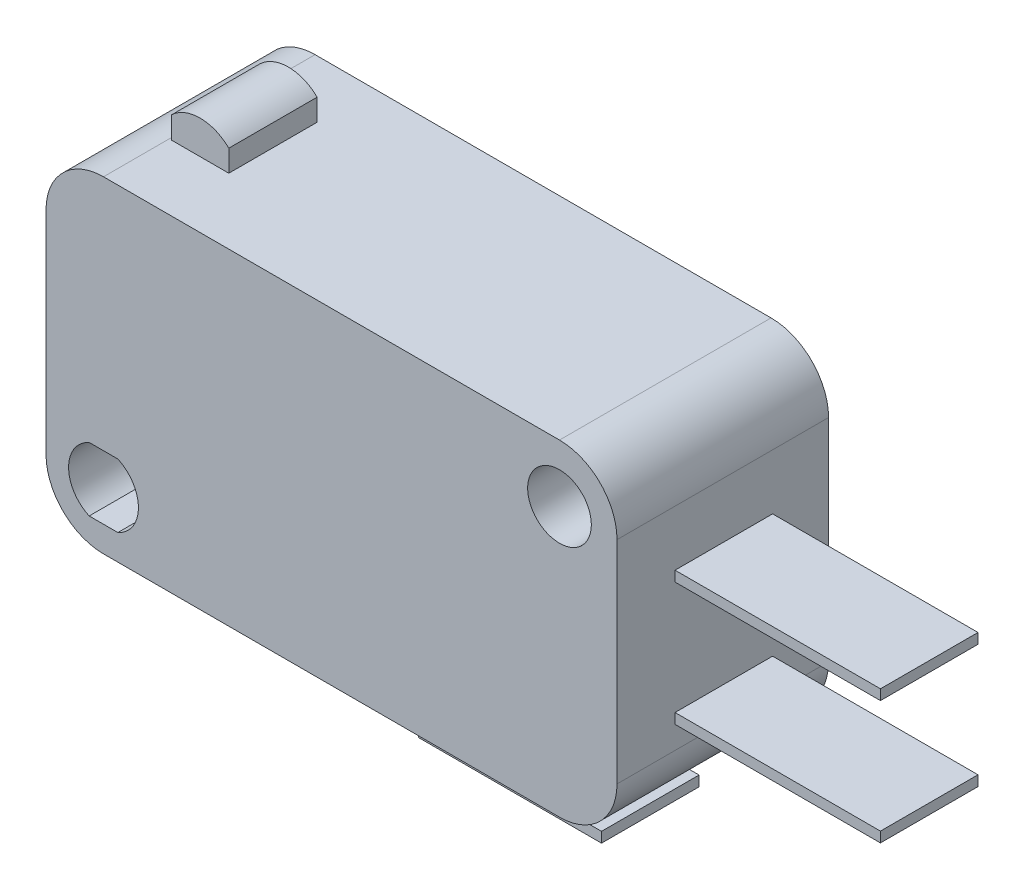
ISO-10303-21;
HEADER;
FILE_DESCRIPTION(('STEP AP214'),'2;1');
FILE_NAME('part.step','',(''),(''),'','','');
FILE_SCHEMA(('AUTOMOTIVE_DESIGN { 1 0 10303 214 1 1 1 1 }'));
ENDSEC;
DATA;
#1=APPLICATION_CONTEXT('core data for automotive mechanical design processes');
#2=APPLICATION_PROTOCOL_DEFINITION('international standard','automotive_design',2000,#1);
#3=PRODUCT_CONTEXT('',#1,'mechanical');
#4=PRODUCT('Part','Part','',(#3));
#5=PRODUCT_RELATED_PRODUCT_CATEGORY('part','',(#4));
#6=PRODUCT_DEFINITION_FORMATION('','',#4);
#7=PRODUCT_DEFINITION_CONTEXT('part definition',#1,'design');
#8=PRODUCT_DEFINITION('design','',#6,#7);
#9=PRODUCT_DEFINITION_SHAPE('','',#8);
#10=(LENGTH_UNIT() NAMED_UNIT(*) SI_UNIT(.MILLI.,.METRE.));
#11=(NAMED_UNIT(*) PLANE_ANGLE_UNIT() SI_UNIT($,.RADIAN.));
#12=(NAMED_UNIT(*) SI_UNIT($,.STERADIAN.) SOLID_ANGLE_UNIT());
#13=UNCERTAINTY_MEASURE_WITH_UNIT(LENGTH_MEASURE(1.E-05),#10,'distance_accuracy_value','');
#14=(GEOMETRIC_REPRESENTATION_CONTEXT(3) GLOBAL_UNCERTAINTY_ASSIGNED_CONTEXT((#13)) GLOBAL_UNIT_ASSIGNED_CONTEXT((#10,
#11,#12)) REPRESENTATION_CONTEXT('',''));
#15=CARTESIAN_POINT('',(0.,0.,0.));
#16=DIRECTION('',(0.,0.,1.));
#17=DIRECTION('',(1.,0.,0.));
#18=AXIS2_PLACEMENT_3D('',#15,#16,#17);
#19=CARTESIAN_POINT('',(-25.,-13.1,5.15));
#20=DIRECTION('',(0.,1.,0.));
#21=DIRECTION('',(-1.,0.,0.));
#22=AXIS2_PLACEMENT_3D('',#19,#20,#21);
#23=PLANE('',#22);
#24=DIRECTION('',(1.,0.,0.));
#25=VECTOR('',#24,1.);
#26=CARTESIAN_POINT('',(-25.,-13.1,5.15));
#27=LINE('',#26,#25);
#28=CARTESIAN_POINT('',(-22.2,-13.1,5.15));
#29=VERTEX_POINT('',#28);
#30=CARTESIAN_POINT('',(0.,-13.1,5.15));
#31=VERTEX_POINT('',#30);
#32=EDGE_CURVE('E411',#29,#31,#27,.T.);
#33=ORIENTED_EDGE('',*,*,#32,.F.);
#34=DIRECTION('',(0.,0.,-1.));
#35=VECTOR('',#34,1.);
#36=CARTESIAN_POINT('',(-22.2,-13.1,5.15));
#37=LINE('',#36,#35);
#38=CARTESIAN_POINT('',(-22.2,-13.1,-5.15));
#39=VERTEX_POINT('',#38);
#40=EDGE_CURVE('E448',#29,#39,#37,.T.);
#41=ORIENTED_EDGE('',*,*,#40,.T.);
#42=DIRECTION('',(1.,0.,0.));
#43=VECTOR('',#42,1.);
#44=CARTESIAN_POINT('',(-25.,-13.1,-5.15));
#45=LINE('',#44,#43);
#46=CARTESIAN_POINT('',(0.,-13.1,-5.15));
#47=VERTEX_POINT('',#46);
#48=EDGE_CURVE('E399',#39,#47,#45,.T.);
#49=ORIENTED_EDGE('',*,*,#48,.T.);
#50=DIRECTION('',(0.,0.,-1.));
#51=VECTOR('',#50,1.);
#52=CARTESIAN_POINT('',(0.,-13.1,5.15));
#53=LINE('',#52,#51);
#54=EDGE_CURVE('E446',#47,#31,#53,.F.);
#55=ORIENTED_EDGE('',*,*,#54,.T.);
#56=EDGE_LOOP('',(#33,#41,#49,#55));
#57=FACE_BOUND('',#56,.T.);
#58=DIRECTION('',(-1.,0.,0.));
#59=VECTOR('',#58,1.);
#60=CARTESIAN_POINT('',(-9.68,-13.1,2.325));
#61=LINE('',#60,#59);
#62=CARTESIAN_POINT('',(-9.18,-13.1,2.325));
#63=VERTEX_POINT('',#62);
#64=CARTESIAN_POINT('',(-9.68,-13.1,2.325));
#65=VERTEX_POINT('',#64);
#66=EDGE_CURVE('E300',#63,#65,#61,.T.);
#67=ORIENTED_EDGE('',*,*,#66,.F.);
#68=DIRECTION('',(0.,0.,-1.));
#69=VECTOR('',#68,1.);
#70=CARTESIAN_POINT('',(-9.18,-13.1,2.325));
#71=LINE('',#70,#69);
#72=CARTESIAN_POINT('',(-9.18,-13.1,-2.425));
#73=VERTEX_POINT('',#72);
#74=EDGE_CURVE('E313',#63,#73,#71,.T.);
#75=ORIENTED_EDGE('',*,*,#74,.T.);
#76=DIRECTION('',(-1.,0.,0.));
#77=VECTOR('',#76,1.);
#78=CARTESIAN_POINT('',(-9.68,-13.1,-2.425));
#79=LINE('',#78,#77);
#80=CARTESIAN_POINT('',(-9.68,-13.1,-2.425));
#81=VERTEX_POINT('',#80);
#82=EDGE_CURVE('E287',#73,#81,#79,.T.);
#83=ORIENTED_EDGE('',*,*,#82,.T.);
#84=DIRECTION('',(0.,0.,-1.));
#85=VECTOR('',#84,1.);
#86=CARTESIAN_POINT('',(-9.68,-13.1,2.325));
#87=LINE('',#86,#85);
#88=EDGE_CURVE('E328',#65,#81,#87,.T.);
#89=ORIENTED_EDGE('',*,*,#88,.F.);
#90=EDGE_LOOP('',(#67,#75,#83,#89));
#91=FACE_BOUND('',#90,.T.);
#92=ADVANCED_FACE('F17',(#57,#91),#23,.F.);
#93=CARTESIAN_POINT('',(2.8,2.8,5.15));
#94=DIRECTION('',(-1.,0.,0.));
#95=DIRECTION('',(0.,-1.,0.));
#96=AXIS2_PLACEMENT_3D('',#93,#94,#95);
#97=PLANE('',#96);
#98=DIRECTION('',(0.,-1.,0.));
#99=VECTOR('',#98,1.);
#100=CARTESIAN_POINT('',(2.8,-2.7,2.325));
#101=LINE('',#100,#99);
#102=CARTESIAN_POINT('',(2.8,-2.7,2.325));
#103=VERTEX_POINT('',#102);
#104=CARTESIAN_POINT('',(2.8,-3.2,2.325));
#105=VERTEX_POINT('',#104);
#106=EDGE_CURVE('E363',#103,#105,#101,.T.);
#107=ORIENTED_EDGE('',*,*,#106,.F.);
#108=DIRECTION('',(0.,0.,1.));
#109=VECTOR('',#108,1.);
#110=CARTESIAN_POINT('',(2.8,-2.7,2.325));
#111=LINE('',#110,#109);
#112=CARTESIAN_POINT('',(2.8,-2.7,-2.425));
#113=VERTEX_POINT('',#112);
#114=EDGE_CURVE('E372',#113,#103,#111,.T.);
#115=ORIENTED_EDGE('',*,*,#114,.F.);
#116=DIRECTION('',(0.,1.,0.));
#117=VECTOR('',#116,1.);
#118=CARTESIAN_POINT('',(2.8,-2.7,-2.425));
#119=LINE('',#118,#117);
#120=CARTESIAN_POINT('',(2.8,-3.2,-2.425));
#121=VERTEX_POINT('',#120);
#122=EDGE_CURVE('E369',#121,#113,#119,.T.);
#123=ORIENTED_EDGE('',*,*,#122,.F.);
#124=DIRECTION('',(0.,0.,-1.));
#125=VECTOR('',#124,1.);
#126=CARTESIAN_POINT('',(2.8,-3.2,2.325));
#127=LINE('',#126,#125);
#128=EDGE_CURVE('E366',#105,#121,#127,.T.);
#129=ORIENTED_EDGE('',*,*,#128,.F.);
#130=EDGE_LOOP('',(#107,#115,#123,#129));
#131=FACE_BOUND('',#130,.T.);
#132=DIRECTION('',(0.,1.,0.));
#133=VECTOR('',#132,1.);
#134=CARTESIAN_POINT('',(2.8,2.8,5.15));
#135=LINE('',#134,#133);
#136=CARTESIAN_POINT('',(2.8,-10.3,5.15));
#137=VERTEX_POINT('',#136);
#138=CARTESIAN_POINT('',(2.8,0.,5.15));
#139=VERTEX_POINT('',#138);
#140=EDGE_CURVE('E414',#137,#139,#135,.T.);
#141=ORIENTED_EDGE('',*,*,#140,.F.);
#142=DIRECTION('',(0.,0.,-1.));
#143=VECTOR('',#142,1.);
#144=CARTESIAN_POINT('',(2.8,-10.3,5.15));
#145=LINE('',#144,#143);
#146=CARTESIAN_POINT('',(2.8,-10.3,-5.15));
#147=VERTEX_POINT('',#146);
#148=EDGE_CURVE('E11',#137,#147,#145,.T.);
#149=ORIENTED_EDGE('',*,*,#148,.T.);
#150=DIRECTION('',(0.,1.,0.));
#151=VECTOR('',#150,1.);
#152=CARTESIAN_POINT('',(2.8,2.8,-5.15));
#153=LINE('',#152,#151);
#154=CARTESIAN_POINT('',(2.8,0.,-5.15));
#155=VERTEX_POINT('',#154);
#156=EDGE_CURVE('E402',#147,#155,#153,.T.);
#157=ORIENTED_EDGE('',*,*,#156,.T.);
#158=DIRECTION('',(0.,0.,-1.));
#159=VECTOR('',#158,1.);
#160=CARTESIAN_POINT('',(2.8,0.,5.15));
#161=LINE('',#160,#159);
#162=EDGE_CURVE('E25',#155,#139,#161,.F.);
#163=ORIENTED_EDGE('',*,*,#162,.T.);
#164=EDGE_LOOP('',(#141,#149,#157,#163));
#165=FACE_BOUND('',#164,.T.);
#166=DIRECTION('',(0.,-1.,0.));
#167=VECTOR('',#166,1.);
#168=CARTESIAN_POINT('',(2.8,-8.7,2.325));
#169=LINE('',#168,#167);
#170=CARTESIAN_POINT('',(2.8,-8.7,2.325));
#171=VERTEX_POINT('',#170);
#172=CARTESIAN_POINT('',(2.8,-9.2,2.325));
#173=VERTEX_POINT('',#172);
#174=EDGE_CURVE('E330',#171,#173,#169,.T.);
#175=ORIENTED_EDGE('',*,*,#174,.F.);
#176=DIRECTION('',(0.,0.,1.));
#177=VECTOR('',#176,1.);
#178=CARTESIAN_POINT('',(2.8,-8.7,2.325));
#179=LINE('',#178,#177);
#180=CARTESIAN_POINT('',(2.8,-8.7,-2.425));
#181=VERTEX_POINT('',#180);
#182=EDGE_CURVE('E339',#181,#171,#179,.T.);
#183=ORIENTED_EDGE('',*,*,#182,.F.);
#184=DIRECTION('',(0.,1.,0.));
#185=VECTOR('',#184,1.);
#186=CARTESIAN_POINT('',(2.8,-8.7,-2.425));
#187=LINE('',#186,#185);
#188=CARTESIAN_POINT('',(2.8,-9.2,-2.425));
#189=VERTEX_POINT('',#188);
#190=EDGE_CURVE('E336',#189,#181,#187,.T.);
#191=ORIENTED_EDGE('',*,*,#190,.F.);
#192=DIRECTION('',(0.,0.,-1.));
#193=VECTOR('',#192,1.);
#194=CARTESIAN_POINT('',(2.8,-9.2,2.325));
#195=LINE('',#194,#193);
#196=EDGE_CURVE('E333',#173,#189,#195,.T.);
#197=ORIENTED_EDGE('',*,*,#196,.F.);
#198=EDGE_LOOP('',(#175,#183,#191,#197));
#199=FACE_BOUND('',#198,.T.);
#200=ADVANCED_FACE('F453',(#131,#165,#199),#97,.F.);
#201=CARTESIAN_POINT('',(-25.,2.8,5.15));
#202=DIRECTION('',(1.,0.,0.));
#203=DIRECTION('',(0.,1.,0.));
#204=AXIS2_PLACEMENT_3D('',#201,#202,#203);
#205=PLANE('',#204);
#206=DIRECTION('',(0.,-1.,0.));
#207=VECTOR('',#206,1.);
#208=CARTESIAN_POINT('',(-25.,2.8,5.15));
#209=LINE('',#208,#207);
#210=CARTESIAN_POINT('',(-25.,0.,5.15));
#211=VERTEX_POINT('',#210);
#212=CARTESIAN_POINT('',(-25.,-10.3,5.15));
#213=VERTEX_POINT('',#212);
#214=EDGE_CURVE('E408',#211,#213,#209,.T.);
#215=ORIENTED_EDGE('',*,*,#214,.F.);
#216=DIRECTION('',(0.,0.,-1.));
#217=VECTOR('',#216,1.);
#218=CARTESIAN_POINT('',(-25.,0.,5.15));
#219=LINE('',#218,#217);
#220=CARTESIAN_POINT('',(-25.,0.,-5.15));
#221=VERTEX_POINT('',#220);
#222=EDGE_CURVE('E422',#211,#221,#219,.T.);
#223=ORIENTED_EDGE('',*,*,#222,.T.);
#224=DIRECTION('',(0.,-1.,0.));
#225=VECTOR('',#224,1.);
#226=CARTESIAN_POINT('',(-25.,2.8,-5.15));
#227=LINE('',#226,#225);
#228=CARTESIAN_POINT('',(-25.,-10.3,-5.15));
#229=VERTEX_POINT('',#228);
#230=EDGE_CURVE('E396',#221,#229,#227,.T.);
#231=ORIENTED_EDGE('',*,*,#230,.T.);
#232=DIRECTION('',(0.,0.,-1.));
#233=VECTOR('',#232,1.);
#234=CARTESIAN_POINT('',(-25.,-10.3,5.15));
#235=LINE('',#234,#233);
#236=EDGE_CURVE('E420',#229,#213,#235,.F.);
#237=ORIENTED_EDGE('',*,*,#236,.T.);
#238=EDGE_LOOP('',(#215,#223,#231,#237));
#239=FACE_BOUND('',#238,.T.);
#240=ADVANCED_FACE('F19',(#239),#205,.F.);
#241=CARTESIAN_POINT('',(-25.,2.8,5.15));
#242=DIRECTION('',(0.,-1.,0.));
#243=DIRECTION('',(0.,0.,-1.));
#244=AXIS2_PLACEMENT_3D('',#241,#242,#243);
#245=PLANE('',#244);
#246=DIRECTION('',(0.,0.,-1.));
#247=VECTOR('',#246,1.);
#248=CARTESIAN_POINT('',(-19.3,2.8,1.95));
#249=LINE('',#248,#247);
#250=CARTESIAN_POINT('',(-19.3,2.8,1.95));
#251=VERTEX_POINT('',#250);
#252=CARTESIAN_POINT('',(-19.3,2.8,-2.35));
#253=VERTEX_POINT('',#252);
#254=EDGE_CURVE('E32',#251,#253,#249,.T.);
#255=ORIENTED_EDGE('',*,*,#254,.F.);
#256=DIRECTION('',(1.,0.,0.));
#257=VECTOR('',#256,1.);
#258=CARTESIAN_POINT('',(-22.1,2.8,1.95));
#259=LINE('',#258,#257);
#260=CARTESIAN_POINT('',(-22.1,2.8,1.95));
#261=VERTEX_POINT('',#260);
#262=EDGE_CURVE('E36',#261,#251,#259,.T.);
#263=ORIENTED_EDGE('',*,*,#262,.F.);
#264=DIRECTION('',(0.,0.,-1.));
#265=VECTOR('',#264,1.);
#266=CARTESIAN_POINT('',(-22.1,2.8,1.95));
#267=LINE('',#266,#265);
#268=CARTESIAN_POINT('',(-22.1,2.8,-2.35));
#269=VERTEX_POINT('',#268);
#270=EDGE_CURVE('E247',#261,#269,#267,.T.);
#271=ORIENTED_EDGE('',*,*,#270,.T.);
#272=DIRECTION('',(1.,0.,0.));
#273=VECTOR('',#272,1.);
#274=CARTESIAN_POINT('',(-22.1,2.8,-2.35));
#275=LINE('',#274,#273);
#276=EDGE_CURVE('E238',#269,#253,#275,.T.);
#277=ORIENTED_EDGE('',*,*,#276,.T.);
#278=EDGE_LOOP('',(#255,#263,#271,#277));
#279=FACE_BOUND('',#278,.T.);
#280=DIRECTION('',(-1.,0.,0.));
#281=VECTOR('',#280,1.);
#282=CARTESIAN_POINT('',(-25.,2.8,-5.15));
#283=LINE('',#282,#281);
#284=CARTESIAN_POINT('',(0.,2.8,-5.15));
#285=VERTEX_POINT('',#284);
#286=CARTESIAN_POINT('',(-22.2,2.8,-5.15));
#287=VERTEX_POINT('',#286);
#288=EDGE_CURVE('E405',#285,#287,#283,.T.);
#289=ORIENTED_EDGE('',*,*,#288,.T.);
#290=DIRECTION('',(0.,0.,-1.));
#291=VECTOR('',#290,1.);
#292=CARTESIAN_POINT('',(-22.2,2.8,5.15));
#293=LINE('',#292,#291);
#294=CARTESIAN_POINT('',(-22.2,2.8,5.15));
#295=VERTEX_POINT('',#294);
#296=EDGE_CURVE('E436',#287,#295,#293,.F.);
#297=ORIENTED_EDGE('',*,*,#296,.T.);
#298=DIRECTION('',(-1.,0.,0.));
#299=VECTOR('',#298,1.);
#300=CARTESIAN_POINT('',(-25.,2.8,5.15));
#301=LINE('',#300,#299);
#302=CARTESIAN_POINT('',(0.,2.8,5.15));
#303=VERTEX_POINT('',#302);
#304=EDGE_CURVE('E417',#303,#295,#301,.T.);
#305=ORIENTED_EDGE('',*,*,#304,.F.);
#306=DIRECTION('',(0.,0.,-1.));
#307=VECTOR('',#306,1.);
#308=CARTESIAN_POINT('',(0.,2.8,5.15));
#309=LINE('',#308,#307);
#310=EDGE_CURVE('E433',#303,#285,#309,.T.);
#311=ORIENTED_EDGE('',*,*,#310,.T.);
#312=EDGE_LOOP('',(#289,#297,#305,#311));
#313=FACE_BOUND('',#312,.T.);
#314=ADVANCED_FACE('F467',(#279,#313),#245,.F.);
#315=CARTESIAN_POINT('',(-25.,2.8,5.15));
#316=DIRECTION('',(0.,0.,1.));
#317=DIRECTION('',(1.,0.,0.));
#318=AXIS2_PLACEMENT_3D('',#315,#316,#317);
#319=PLANE('',#318);
#320=CARTESIAN_POINT('',(-22.2,-10.3,5.15));
#321=DIRECTION('',(0.,0.,1.));
#322=DIRECTION('',(1.,0.,0.));
#323=AXIS2_PLACEMENT_3D('',#320,#321,#322);
#324=CIRCLE('',#323,1.7);
#325=CARTESIAN_POINT('',(-22.8982120021885,-8.75,5.15));
#326=VERTEX_POINT('',#325);
#327=CARTESIAN_POINT('',(-22.8982120021885,-11.85,5.15));
#328=VERTEX_POINT('',#327);
#329=EDGE_CURVE('E222',#326,#328,#324,.T.);
#330=ORIENTED_EDGE('',*,*,#329,.F.);
#331=DIRECTION('',(-1.,0.,0.));
#332=VECTOR('',#331,1.);
#333=CARTESIAN_POINT('',(-22.8982120021885,-8.75,5.15));
#334=LINE('',#333,#332);
#335=CARTESIAN_POINT('',(-21.5017879978116,-8.75,5.15));
#336=VERTEX_POINT('',#335);
#337=EDGE_CURVE('E257',#336,#326,#334,.T.);
#338=ORIENTED_EDGE('',*,*,#337,.F.);
#339=CARTESIAN_POINT('',(-22.2,-10.3,5.15));
#340=DIRECTION('',(0.,0.,1.));
#341=DIRECTION('',(1.,0.,0.));
#342=AXIS2_PLACEMENT_3D('',#339,#340,#341);
#343=CIRCLE('',#342,1.7);
#344=CARTESIAN_POINT('',(-21.5017879978116,-11.85,5.15));
#345=VERTEX_POINT('',#344);
#346=EDGE_CURVE('E254',#345,#336,#343,.T.);
#347=ORIENTED_EDGE('',*,*,#346,.F.);
#348=DIRECTION('',(1.,0.,0.));
#349=VECTOR('',#348,1.);
#350=CARTESIAN_POINT('',(-22.8982120021885,-11.85,5.15));
#351=LINE('',#350,#349);
#352=EDGE_CURVE('E251',#328,#345,#351,.T.);
#353=ORIENTED_EDGE('',*,*,#352,.F.);
#354=EDGE_LOOP('',(#330,#338,#347,#353));
#355=FACE_BOUND('',#354,.T.);
#356=CARTESIAN_POINT('',(0.,0.,5.15));
#357=DIRECTION('',(0.,0.,1.));
#358=DIRECTION('',(1.,0.,0.));
#359=AXIS2_PLACEMENT_3D('',#356,#357,#358);
#360=CIRCLE('',#359,1.55);
#361=CARTESIAN_POINT('',(1.55,0.,5.15));
#362=VERTEX_POINT('',#361);
#363=EDGE_CURVE('E275',#362,#362,#360,.T.);
#364=ORIENTED_EDGE('',*,*,#363,.F.);
#365=EDGE_LOOP('',(#364));
#366=FACE_BOUND('',#365,.T.);
#367=ORIENTED_EDGE('',*,*,#304,.T.);
#368=CARTESIAN_POINT('',(-22.2,0.,5.15));
#369=DIRECTION('',(0.,0.,1.));
#370=DIRECTION('',(1.,0.,0.));
#371=AXIS2_PLACEMENT_3D('',#368,#369,#370);
#372=CIRCLE('',#371,2.8);
#373=EDGE_CURVE('E444',#295,#211,#372,.T.);
#374=ORIENTED_EDGE('',*,*,#373,.T.);
#375=ORIENTED_EDGE('',*,*,#214,.T.);
#376=CARTESIAN_POINT('',(-22.2,-10.3,5.15));
#377=DIRECTION('',(0.,0.,1.));
#378=DIRECTION('',(1.,0.,0.));
#379=AXIS2_PLACEMENT_3D('',#376,#377,#378);
#380=CIRCLE('',#379,2.8);
#381=EDGE_CURVE('E442',#213,#29,#380,.T.);
#382=ORIENTED_EDGE('',*,*,#381,.T.);
#383=ORIENTED_EDGE('',*,*,#32,.T.);
#384=CARTESIAN_POINT('',(0.,-10.3,5.15));
#385=DIRECTION('',(0.,0.,1.));
#386=DIRECTION('',(1.,0.,0.));
#387=AXIS2_PLACEMENT_3D('',#384,#385,#386);
#388=CIRCLE('',#387,2.8);
#389=EDGE_CURVE('E440',#31,#137,#388,.T.);
#390=ORIENTED_EDGE('',*,*,#389,.T.);
#391=ORIENTED_EDGE('',*,*,#140,.T.);
#392=CARTESIAN_POINT('',(0.,0.,5.15));
#393=DIRECTION('',(0.,0.,1.));
#394=DIRECTION('',(1.,0.,0.));
#395=AXIS2_PLACEMENT_3D('',#392,#393,#394);
#396=CIRCLE('',#395,2.8);
#397=EDGE_CURVE('E438',#139,#303,#396,.T.);
#398=ORIENTED_EDGE('',*,*,#397,.T.);
#399=EDGE_LOOP('',(#367,#374,#375,#382,#383,#390,#391,#398));
#400=FACE_BOUND('',#399,.T.);
#401=ADVANCED_FACE('F460',(#355,#366,#400),#319,.T.);
#402=CARTESIAN_POINT('',(-25.,2.8,-5.15));
#403=DIRECTION('',(0.,0.,1.));
#404=DIRECTION('',(1.,0.,0.));
#405=AXIS2_PLACEMENT_3D('',#402,#403,#404);
#406=PLANE('',#405);
#407=DIRECTION('',(-1.,0.,0.));
#408=VECTOR('',#407,1.);
#409=CARTESIAN_POINT('',(-22.8982120021885,-8.75,-5.15));
#410=LINE('',#409,#408);
#411=CARTESIAN_POINT('',(-21.5017879978116,-8.75,-5.15));
#412=VERTEX_POINT('',#411);
#413=CARTESIAN_POINT('',(-22.8982120021885,-8.75,-5.15));
#414=VERTEX_POINT('',#413);
#415=EDGE_CURVE('E269',#412,#414,#410,.T.);
#416=ORIENTED_EDGE('',*,*,#415,.T.);
#417=CARTESIAN_POINT('',(-22.2,-10.3,-5.15));
#418=DIRECTION('',(0.,0.,1.));
#419=DIRECTION('',(1.,0.,0.));
#420=AXIS2_PLACEMENT_3D('',#417,#418,#419);
#421=CIRCLE('',#420,1.7);
#422=CARTESIAN_POINT('',(-22.8982120021885,-11.85,-5.15));
#423=VERTEX_POINT('',#422);
#424=EDGE_CURVE('E260',#414,#423,#421,.T.);
#425=ORIENTED_EDGE('',*,*,#424,.T.);
#426=DIRECTION('',(1.,0.,0.));
#427=VECTOR('',#426,1.);
#428=CARTESIAN_POINT('',(-22.8982120021885,-11.85,-5.15));
#429=LINE('',#428,#427);
#430=CARTESIAN_POINT('',(-21.5017879978116,-11.85,-5.15));
#431=VERTEX_POINT('',#430);
#432=EDGE_CURVE('E263',#423,#431,#429,.T.);
#433=ORIENTED_EDGE('',*,*,#432,.T.);
#434=CARTESIAN_POINT('',(-22.2,-10.3,-5.15));
#435=DIRECTION('',(0.,0.,1.));
#436=DIRECTION('',(1.,0.,0.));
#437=AXIS2_PLACEMENT_3D('',#434,#435,#436);
#438=CIRCLE('',#437,1.7);
#439=EDGE_CURVE('E266',#431,#412,#438,.T.);
#440=ORIENTED_EDGE('',*,*,#439,.T.);
#441=EDGE_LOOP('',(#416,#425,#433,#440));
#442=FACE_BOUND('',#441,.T.);
#443=CARTESIAN_POINT('',(0.,0.,-5.15));
#444=DIRECTION('',(0.,0.,1.));
#445=DIRECTION('',(1.,0.,0.));
#446=AXIS2_PLACEMENT_3D('',#443,#444,#445);
#447=CIRCLE('',#446,1.55);
#448=CARTESIAN_POINT('',(1.55,0.,-5.15));
#449=VERTEX_POINT('',#448);
#450=EDGE_CURVE('E284',#449,#449,#447,.T.);
#451=ORIENTED_EDGE('',*,*,#450,.T.);
#452=EDGE_LOOP('',(#451));
#453=FACE_BOUND('',#452,.T.);
#454=ORIENTED_EDGE('',*,*,#230,.F.);
#455=CARTESIAN_POINT('',(-22.2,0.,-5.15));
#456=DIRECTION('',(0.,0.,1.));
#457=DIRECTION('',(1.,0.,0.));
#458=AXIS2_PLACEMENT_3D('',#455,#456,#457);
#459=CIRCLE('',#458,2.8);
#460=EDGE_CURVE('E431',#221,#287,#459,.F.);
#461=ORIENTED_EDGE('',*,*,#460,.T.);
#462=ORIENTED_EDGE('',*,*,#288,.F.);
#463=CARTESIAN_POINT('',(0.,0.,-5.15));
#464=DIRECTION('',(0.,0.,1.));
#465=DIRECTION('',(1.,0.,0.));
#466=AXIS2_PLACEMENT_3D('',#463,#464,#465);
#467=CIRCLE('',#466,2.8);
#468=EDGE_CURVE('E425',#285,#155,#467,.F.);
#469=ORIENTED_EDGE('',*,*,#468,.T.);
#470=ORIENTED_EDGE('',*,*,#156,.F.);
#471=CARTESIAN_POINT('',(0.,-10.3,-5.15));
#472=DIRECTION('',(0.,0.,1.));
#473=DIRECTION('',(1.,0.,0.));
#474=AXIS2_PLACEMENT_3D('',#471,#472,#473);
#475=CIRCLE('',#474,2.8);
#476=EDGE_CURVE('E427',#147,#47,#475,.F.);
#477=ORIENTED_EDGE('',*,*,#476,.T.);
#478=ORIENTED_EDGE('',*,*,#48,.F.);
#479=CARTESIAN_POINT('',(-22.2,-10.3,-5.15));
#480=DIRECTION('',(0.,0.,1.));
#481=DIRECTION('',(1.,0.,0.));
#482=AXIS2_PLACEMENT_3D('',#479,#480,#481);
#483=CIRCLE('',#482,2.8);
#484=EDGE_CURVE('E429',#39,#229,#483,.F.);
#485=ORIENTED_EDGE('',*,*,#484,.T.);
#486=EDGE_LOOP('',(#454,#461,#462,#469,#470,#477,#478,#485));
#487=FACE_BOUND('',#486,.T.);
#488=ADVANCED_FACE('F471',(#442,#453,#487),#406,.F.);
#489=CARTESIAN_POINT('',(12.8,-2.7,2.325));
#490=DIRECTION('',(0.,0.,-1.));
#491=DIRECTION('',(0.,1.,0.));
#492=AXIS2_PLACEMENT_3D('',#489,#490,#491);
#493=PLANE('',#492);
#494=ORIENTED_EDGE('',*,*,#106,.T.);
#495=DIRECTION('',(-1.,0.,0.));
#496=VECTOR('',#495,1.);
#497=CARTESIAN_POINT('',(12.8,-3.2,2.325));
#498=LINE('',#497,#496);
#499=CARTESIAN_POINT('',(12.8,-3.2,2.325));
#500=VERTEX_POINT('',#499);
#501=EDGE_CURVE('E393',#500,#105,#498,.T.);
#502=ORIENTED_EDGE('',*,*,#501,.F.);
#503=DIRECTION('',(0.,-1.,0.));
#504=VECTOR('',#503,1.);
#505=CARTESIAN_POINT('',(12.8,-2.7,2.325));
#506=LINE('',#505,#504);
#507=CARTESIAN_POINT('',(12.8,-2.7,2.325));
#508=VERTEX_POINT('',#507);
#509=EDGE_CURVE('E375',#508,#500,#506,.T.);
#510=ORIENTED_EDGE('',*,*,#509,.F.);
#511=DIRECTION('',(-1.,0.,0.));
#512=VECTOR('',#511,1.);
#513=CARTESIAN_POINT('',(12.8,-2.7,2.325));
#514=LINE('',#513,#512);
#515=EDGE_CURVE('E384',#508,#103,#514,.T.);
#516=ORIENTED_EDGE('',*,*,#515,.T.);
#517=EDGE_LOOP('',(#494,#502,#510,#516));
#518=FACE_BOUND('',#517,.T.);
#519=ADVANCED_FACE('F513',(#518),#493,.F.);
#520=CARTESIAN_POINT('',(12.8,-3.2,2.325));
#521=DIRECTION('',(0.,1.,0.));
#522=DIRECTION('',(-1.,0.,0.));
#523=AXIS2_PLACEMENT_3D('',#520,#521,#522);
#524=PLANE('',#523);
#525=ORIENTED_EDGE('',*,*,#128,.T.);
#526=DIRECTION('',(-1.,0.,0.));
#527=VECTOR('',#526,1.);
#528=CARTESIAN_POINT('',(12.8,-3.2,-2.425));
#529=LINE('',#528,#527);
#530=CARTESIAN_POINT('',(12.8,-3.2,-2.425));
#531=VERTEX_POINT('',#530);
#532=EDGE_CURVE('E390',#531,#121,#529,.T.);
#533=ORIENTED_EDGE('',*,*,#532,.F.);
#534=DIRECTION('',(0.,0.,-1.));
#535=VECTOR('',#534,1.);
#536=CARTESIAN_POINT('',(12.8,-3.2,2.325));
#537=LINE('',#536,#535);
#538=EDGE_CURVE('E378',#500,#531,#537,.T.);
#539=ORIENTED_EDGE('',*,*,#538,.F.);
#540=ORIENTED_EDGE('',*,*,#501,.T.);
#541=EDGE_LOOP('',(#525,#533,#539,#540));
#542=FACE_BOUND('',#541,.T.);
#543=ADVANCED_FACE('F517',(#542),#524,.F.);
#544=CARTESIAN_POINT('',(12.8,-2.7,-2.425));
#545=DIRECTION('',(0.,0.,1.));
#546=DIRECTION('',(0.,-1.,0.));
#547=AXIS2_PLACEMENT_3D('',#544,#545,#546);
#548=PLANE('',#547);
#549=ORIENTED_EDGE('',*,*,#122,.T.);
#550=DIRECTION('',(-1.,0.,0.));
#551=VECTOR('',#550,1.);
#552=CARTESIAN_POINT('',(12.8,-2.7,-2.425));
#553=LINE('',#552,#551);
#554=CARTESIAN_POINT('',(12.8,-2.7,-2.425));
#555=VERTEX_POINT('',#554);
#556=EDGE_CURVE('E387',#555,#113,#553,.T.);
#557=ORIENTED_EDGE('',*,*,#556,.F.);
#558=DIRECTION('',(0.,1.,0.));
#559=VECTOR('',#558,1.);
#560=CARTESIAN_POINT('',(12.8,-2.7,-2.425));
#561=LINE('',#560,#559);
#562=EDGE_CURVE('E380',#531,#555,#561,.T.);
#563=ORIENTED_EDGE('',*,*,#562,.F.);
#564=ORIENTED_EDGE('',*,*,#532,.T.);
#565=EDGE_LOOP('',(#549,#557,#563,#564));
#566=FACE_BOUND('',#565,.T.);
#567=ADVANCED_FACE('F521',(#566),#548,.F.);
#568=CARTESIAN_POINT('',(12.8,-2.7,2.325));
#569=DIRECTION('',(0.,-1.,0.));
#570=DIRECTION('',(1.,0.,0.));
#571=AXIS2_PLACEMENT_3D('',#568,#569,#570);
#572=PLANE('',#571);
#573=ORIENTED_EDGE('',*,*,#114,.T.);
#574=ORIENTED_EDGE('',*,*,#515,.F.);
#575=DIRECTION('',(0.,0.,1.));
#576=VECTOR('',#575,1.);
#577=CARTESIAN_POINT('',(12.8,-2.7,2.325));
#578=LINE('',#577,#576);
#579=EDGE_CURVE('E382',#555,#508,#578,.T.);
#580=ORIENTED_EDGE('',*,*,#579,.F.);
#581=ORIENTED_EDGE('',*,*,#556,.T.);
#582=EDGE_LOOP('',(#573,#574,#580,#581));
#583=FACE_BOUND('',#582,.T.);
#584=ADVANCED_FACE('F525',(#583),#572,.F.);
#585=CARTESIAN_POINT('',(12.8,-3.2,2.325));
#586=DIRECTION('',(1.,0.,0.));
#587=DIRECTION('',(0.,0.,-1.));
#588=AXIS2_PLACEMENT_3D('',#585,#586,#587);
#589=PLANE('',#588);
#590=ORIENTED_EDGE('',*,*,#509,.T.);
#591=ORIENTED_EDGE('',*,*,#538,.T.);
#592=ORIENTED_EDGE('',*,*,#562,.T.);
#593=ORIENTED_EDGE('',*,*,#579,.T.);
#594=EDGE_LOOP('',(#590,#591,#592,#593));
#595=FACE_BOUND('',#594,.T.);
#596=ADVANCED_FACE('F529',(#595),#589,.T.);
#597=CARTESIAN_POINT('',(12.8,-8.7,2.325));
#598=DIRECTION('',(0.,0.,-1.));
#599=DIRECTION('',(0.,1.,0.));
#600=AXIS2_PLACEMENT_3D('',#597,#598,#599);
#601=PLANE('',#600);
#602=ORIENTED_EDGE('',*,*,#174,.T.);
#603=DIRECTION('',(-1.,0.,0.));
#604=VECTOR('',#603,1.);
#605=CARTESIAN_POINT('',(12.8,-9.2,2.325));
#606=LINE('',#605,#604);
#607=CARTESIAN_POINT('',(12.8,-9.2,2.325));
#608=VERTEX_POINT('',#607);
#609=EDGE_CURVE('E360',#608,#173,#606,.T.);
#610=ORIENTED_EDGE('',*,*,#609,.F.);
#611=DIRECTION('',(0.,-1.,0.));
#612=VECTOR('',#611,1.);
#613=CARTESIAN_POINT('',(12.8,-8.7,2.325));
#614=LINE('',#613,#612);
#615=CARTESIAN_POINT('',(12.8,-8.7,2.325));
#616=VERTEX_POINT('',#615);
#617=EDGE_CURVE('E342',#616,#608,#614,.T.);
#618=ORIENTED_EDGE('',*,*,#617,.F.);
#619=DIRECTION('',(-1.,0.,0.));
#620=VECTOR('',#619,1.);
#621=CARTESIAN_POINT('',(12.8,-8.7,2.325));
#622=LINE('',#621,#620);
#623=EDGE_CURVE('E351',#616,#171,#622,.T.);
#624=ORIENTED_EDGE('',*,*,#623,.T.);
#625=EDGE_LOOP('',(#602,#610,#618,#624));
#626=FACE_BOUND('',#625,.T.);
#627=ADVANCED_FACE('F533',(#626),#601,.F.);
#628=CARTESIAN_POINT('',(12.8,-9.2,2.325));
#629=DIRECTION('',(0.,1.,0.));
#630=DIRECTION('',(-1.,0.,0.));
#631=AXIS2_PLACEMENT_3D('',#628,#629,#630);
#632=PLANE('',#631);
#633=ORIENTED_EDGE('',*,*,#196,.T.);
#634=DIRECTION('',(-1.,0.,0.));
#635=VECTOR('',#634,1.);
#636=CARTESIAN_POINT('',(12.8,-9.2,-2.425));
#637=LINE('',#636,#635);
#638=CARTESIAN_POINT('',(12.8,-9.2,-2.425));
#639=VERTEX_POINT('',#638);
#640=EDGE_CURVE('E357',#639,#189,#637,.T.);
#641=ORIENTED_EDGE('',*,*,#640,.F.);
#642=DIRECTION('',(0.,0.,-1.));
#643=VECTOR('',#642,1.);
#644=CARTESIAN_POINT('',(12.8,-9.2,2.325));
#645=LINE('',#644,#643);
#646=EDGE_CURVE('E345',#608,#639,#645,.T.);
#647=ORIENTED_EDGE('',*,*,#646,.F.);
#648=ORIENTED_EDGE('',*,*,#609,.T.);
#649=EDGE_LOOP('',(#633,#641,#647,#648));
#650=FACE_BOUND('',#649,.T.);
#651=ADVANCED_FACE('F537',(#650),#632,.F.);
#652=CARTESIAN_POINT('',(12.8,-8.7,-2.425));
#653=DIRECTION('',(0.,0.,1.));
#654=DIRECTION('',(1.,0.,0.));
#655=AXIS2_PLACEMENT_3D('',#652,#653,#654);
#656=PLANE('',#655);
#657=ORIENTED_EDGE('',*,*,#190,.T.);
#658=DIRECTION('',(-1.,0.,0.));
#659=VECTOR('',#658,1.);
#660=CARTESIAN_POINT('',(12.8,-8.7,-2.425));
#661=LINE('',#660,#659);
#662=CARTESIAN_POINT('',(12.8,-8.7,-2.425));
#663=VERTEX_POINT('',#662);
#664=EDGE_CURVE('E354',#663,#181,#661,.T.);
#665=ORIENTED_EDGE('',*,*,#664,.F.);
#666=DIRECTION('',(0.,1.,0.));
#667=VECTOR('',#666,1.);
#668=CARTESIAN_POINT('',(12.8,-8.7,-2.425));
#669=LINE('',#668,#667);
#670=EDGE_CURVE('E347',#639,#663,#669,.T.);
#671=ORIENTED_EDGE('',*,*,#670,.F.);
#672=ORIENTED_EDGE('',*,*,#640,.T.);
#673=EDGE_LOOP('',(#657,#665,#671,#672));
#674=FACE_BOUND('',#673,.T.);
#675=ADVANCED_FACE('F541',(#674),#656,.F.);
#676=CARTESIAN_POINT('',(12.8,-8.7,2.325));
#677=DIRECTION('',(0.,-1.,0.));
#678=DIRECTION('',(1.,0.,0.));
#679=AXIS2_PLACEMENT_3D('',#676,#677,#678);
#680=PLANE('',#679);
#681=ORIENTED_EDGE('',*,*,#182,.T.);
#682=ORIENTED_EDGE('',*,*,#623,.F.);
#683=DIRECTION('',(0.,0.,1.));
#684=VECTOR('',#683,1.);
#685=CARTESIAN_POINT('',(12.8,-8.7,2.325));
#686=LINE('',#685,#684);
#687=EDGE_CURVE('E349',#663,#616,#686,.T.);
#688=ORIENTED_EDGE('',*,*,#687,.F.);
#689=ORIENTED_EDGE('',*,*,#664,.T.);
#690=EDGE_LOOP('',(#681,#682,#688,#689));
#691=FACE_BOUND('',#690,.T.);
#692=ADVANCED_FACE('F545',(#691),#680,.F.);
#693=CARTESIAN_POINT('',(12.8,-9.2,2.325));
#694=DIRECTION('',(1.,0.,0.));
#695=DIRECTION('',(0.,0.,-1.));
#696=AXIS2_PLACEMENT_3D('',#693,#694,#695);
#697=PLANE('',#696);
#698=ORIENTED_EDGE('',*,*,#617,.T.);
#699=ORIENTED_EDGE('',*,*,#646,.T.);
#700=ORIENTED_EDGE('',*,*,#670,.T.);
#701=ORIENTED_EDGE('',*,*,#687,.T.);
#702=EDGE_LOOP('',(#698,#699,#700,#701));
#703=FACE_BOUND('',#702,.T.);
#704=ADVANCED_FACE('F549',(#703),#697,.T.);
#705=CARTESIAN_POINT('',(-9.68,-16.,2.325));
#706=DIRECTION('',(1.,0.,0.));
#707=DIRECTION('',(0.,1.,0.));
#708=AXIS2_PLACEMENT_3D('',#705,#706,#707);
#709=PLANE('',#708);
#710=DIRECTION('',(0.,-1.,0.));
#711=VECTOR('',#710,1.);
#712=CARTESIAN_POINT('',(-9.68,-16.,-2.425));
#713=LINE('',#712,#711);
#714=CARTESIAN_POINT('',(-9.68,-16.,-2.425));
#715=VERTEX_POINT('',#714);
#716=EDGE_CURVE('E290',#81,#715,#713,.T.);
#717=ORIENTED_EDGE('',*,*,#716,.T.);
#718=DIRECTION('',(0.,0.,-1.));
#719=VECTOR('',#718,1.);
#720=CARTESIAN_POINT('',(-9.68,-16.,2.325));
#721=LINE('',#720,#719);
#722=CARTESIAN_POINT('',(-9.68,-16.,2.325));
#723=VERTEX_POINT('',#722);
#724=EDGE_CURVE('E325',#723,#715,#721,.T.);
#725=ORIENTED_EDGE('',*,*,#724,.F.);
#726=DIRECTION('',(0.,-1.,0.));
#727=VECTOR('',#726,1.);
#728=CARTESIAN_POINT('',(-9.68,-16.,2.325));
#729=LINE('',#728,#727);
#730=EDGE_CURVE('E303',#65,#723,#729,.T.);
#731=ORIENTED_EDGE('',*,*,#730,.F.);
#732=ORIENTED_EDGE('',*,*,#88,.T.);
#733=EDGE_LOOP('',(#717,#725,#731,#732));
#734=FACE_BOUND('',#733,.T.);
#735=ADVANCED_FACE('F553',(#734),#709,.F.);
#736=CARTESIAN_POINT('',(-0.78,-16.,2.325));
#737=DIRECTION('',(0.,1.,0.));
#738=DIRECTION('',(0.,0.,1.));
#739=AXIS2_PLACEMENT_3D('',#736,#737,#738);
#740=PLANE('',#739);
#741=DIRECTION('',(1.,0.,0.));
#742=VECTOR('',#741,1.);
#743=CARTESIAN_POINT('',(-0.78,-16.,-2.425));
#744=LINE('',#743,#742);
#745=CARTESIAN_POINT('',(-0.78,-16.,-2.425));
#746=VERTEX_POINT('',#745);
#747=EDGE_CURVE('E292',#715,#746,#744,.T.);
#748=ORIENTED_EDGE('',*,*,#747,.T.);
#749=DIRECTION('',(0.,0.,-1.));
#750=VECTOR('',#749,1.);
#751=CARTESIAN_POINT('',(-0.78,-16.,2.325));
#752=LINE('',#751,#750);
#753=CARTESIAN_POINT('',(-0.78,-16.,2.325));
#754=VERTEX_POINT('',#753);
#755=EDGE_CURVE('E322',#754,#746,#752,.T.);
#756=ORIENTED_EDGE('',*,*,#755,.F.);
#757=DIRECTION('',(1.,0.,0.));
#758=VECTOR('',#757,1.);
#759=CARTESIAN_POINT('',(-0.78,-16.,2.325));
#760=LINE('',#759,#758);
#761=EDGE_CURVE('E305',#723,#754,#760,.T.);
#762=ORIENTED_EDGE('',*,*,#761,.F.);
#763=ORIENTED_EDGE('',*,*,#724,.T.);
#764=EDGE_LOOP('',(#748,#756,#762,#763));
#765=FACE_BOUND('',#764,.T.);
#766=ADVANCED_FACE('F557',(#765),#740,.F.);
#767=CARTESIAN_POINT('',(-0.78,-15.5,2.325));
#768=DIRECTION('',(-1.,0.,0.));
#769=DIRECTION('',(0.,0.,1.));
#770=AXIS2_PLACEMENT_3D('',#767,#768,#769);
#771=PLANE('',#770);
#772=DIRECTION('',(0.,1.,0.));
#773=VECTOR('',#772,1.);
#774=CARTESIAN_POINT('',(-0.78,-15.5,-2.425));
#775=LINE('',#774,#773);
#776=CARTESIAN_POINT('',(-0.78,-15.5,-2.425));
#777=VERTEX_POINT('',#776);
#778=EDGE_CURVE('E294',#746,#777,#775,.T.);
#779=ORIENTED_EDGE('',*,*,#778,.T.);
#780=DIRECTION('',(0.,0.,-1.));
#781=VECTOR('',#780,1.);
#782=CARTESIAN_POINT('',(-0.78,-15.5,2.325));
#783=LINE('',#782,#781);
#784=CARTESIAN_POINT('',(-0.78,-15.5,2.325));
#785=VERTEX_POINT('',#784);
#786=EDGE_CURVE('E319',#785,#777,#783,.T.);
#787=ORIENTED_EDGE('',*,*,#786,.F.);
#788=DIRECTION('',(0.,1.,0.));
#789=VECTOR('',#788,1.);
#790=CARTESIAN_POINT('',(-0.78,-15.5,2.325));
#791=LINE('',#790,#789);
#792=EDGE_CURVE('E307',#754,#785,#791,.T.);
#793=ORIENTED_EDGE('',*,*,#792,.F.);
#794=ORIENTED_EDGE('',*,*,#755,.T.);
#795=EDGE_LOOP('',(#779,#787,#793,#794));
#796=FACE_BOUND('',#795,.T.);
#797=ADVANCED_FACE('F561',(#796),#771,.F.);
#798=CARTESIAN_POINT('',(-9.18,-15.5,2.325));
#799=DIRECTION('',(0.,-1.,0.));
#800=DIRECTION('',(0.,0.,-1.));
#801=AXIS2_PLACEMENT_3D('',#798,#799,#800);
#802=PLANE('',#801);
#803=DIRECTION('',(-1.,0.,0.));
#804=VECTOR('',#803,1.);
#805=CARTESIAN_POINT('',(-9.18,-15.5,-2.425));
#806=LINE('',#805,#804);
#807=CARTESIAN_POINT('',(-9.18,-15.5,-2.425));
#808=VERTEX_POINT('',#807);
#809=EDGE_CURVE('E296',#777,#808,#806,.T.);
#810=ORIENTED_EDGE('',*,*,#809,.T.);
#811=DIRECTION('',(0.,0.,-1.));
#812=VECTOR('',#811,1.);
#813=CARTESIAN_POINT('',(-9.18,-15.5,2.325));
#814=LINE('',#813,#812);
#815=CARTESIAN_POINT('',(-9.18,-15.5,2.325));
#816=VERTEX_POINT('',#815);
#817=EDGE_CURVE('E316',#816,#808,#814,.T.);
#818=ORIENTED_EDGE('',*,*,#817,.F.);
#819=DIRECTION('',(-1.,0.,0.));
#820=VECTOR('',#819,1.);
#821=CARTESIAN_POINT('',(-9.18,-15.5,2.325));
#822=LINE('',#821,#820);
#823=EDGE_CURVE('E309',#785,#816,#822,.T.);
#824=ORIENTED_EDGE('',*,*,#823,.F.);
#825=ORIENTED_EDGE('',*,*,#786,.T.);
#826=EDGE_LOOP('',(#810,#818,#824,#825));
#827=FACE_BOUND('',#826,.T.);
#828=ADVANCED_FACE('F565',(#827),#802,.F.);
#829=CARTESIAN_POINT('',(-9.18,-13.1,2.325));
#830=DIRECTION('',(-1.,0.,0.));
#831=DIRECTION('',(0.,0.,1.));
#832=AXIS2_PLACEMENT_3D('',#829,#830,#831);
#833=PLANE('',#832);
#834=DIRECTION('',(0.,1.,0.));
#835=VECTOR('',#834,1.);
#836=CARTESIAN_POINT('',(-9.18,-13.1,-2.425));
#837=LINE('',#836,#835);
#838=EDGE_CURVE('E298',#808,#73,#837,.T.);
#839=ORIENTED_EDGE('',*,*,#838,.T.);
#840=ORIENTED_EDGE('',*,*,#74,.F.);
#841=DIRECTION('',(0.,1.,0.));
#842=VECTOR('',#841,1.);
#843=CARTESIAN_POINT('',(-9.18,-13.1,2.325));
#844=LINE('',#843,#842);
#845=EDGE_CURVE('E311',#816,#63,#844,.T.);
#846=ORIENTED_EDGE('',*,*,#845,.F.);
#847=ORIENTED_EDGE('',*,*,#817,.T.);
#848=EDGE_LOOP('',(#839,#840,#846,#847));
#849=FACE_BOUND('',#848,.T.);
#850=ADVANCED_FACE('F569',(#849),#833,.F.);
#851=CARTESIAN_POINT('',(-9.18,-13.1,2.325));
#852=DIRECTION('',(0.,0.,-1.));
#853=DIRECTION('',(-1.,0.,0.));
#854=AXIS2_PLACEMENT_3D('',#851,#852,#853);
#855=PLANE('',#854);
#856=ORIENTED_EDGE('',*,*,#66,.T.);
#857=ORIENTED_EDGE('',*,*,#730,.T.);
#858=ORIENTED_EDGE('',*,*,#761,.T.);
#859=ORIENTED_EDGE('',*,*,#792,.T.);
#860=ORIENTED_EDGE('',*,*,#823,.T.);
#861=ORIENTED_EDGE('',*,*,#845,.T.);
#862=EDGE_LOOP('',(#856,#857,#858,#859,#860,#861));
#863=FACE_BOUND('',#862,.T.);
#864=ADVANCED_FACE('F573',(#863),#855,.F.);
#865=CARTESIAN_POINT('',(-9.18,-13.1,-2.425));
#866=DIRECTION('',(0.,0.,-1.));
#867=DIRECTION('',(-1.,0.,0.));
#868=AXIS2_PLACEMENT_3D('',#865,#866,#867);
#869=PLANE('',#868);
#870=ORIENTED_EDGE('',*,*,#82,.F.);
#871=ORIENTED_EDGE('',*,*,#838,.F.);
#872=ORIENTED_EDGE('',*,*,#809,.F.);
#873=ORIENTED_EDGE('',*,*,#778,.F.);
#874=ORIENTED_EDGE('',*,*,#747,.F.);
#875=ORIENTED_EDGE('',*,*,#716,.F.);
#876=EDGE_LOOP('',(#870,#871,#872,#873,#874,#875));
#877=FACE_BOUND('',#876,.T.);
#878=ADVANCED_FACE('F577',(#877),#869,.T.);
#879=CARTESIAN_POINT('',(0.,0.,-5.15));
#880=DIRECTION('',(0.,0.,1.));
#881=DIRECTION('',(1.,0.,0.));
#882=AXIS2_PLACEMENT_3D('',#879,#880,#881);
#883=CYLINDRICAL_SURFACE('',#882,1.55);
#884=ORIENTED_EDGE('',*,*,#450,.F.);
#885=EDGE_LOOP('',(#884));
#886=FACE_BOUND('',#885,.T.);
#887=ORIENTED_EDGE('',*,*,#363,.T.);
#888=EDGE_LOOP('',(#887));
#889=FACE_BOUND('',#888,.T.);
#890=ADVANCED_FACE('F581',(#886,#889),#883,.F.);
#891=CARTESIAN_POINT('',(-22.2,-10.3,-5.15));
#892=DIRECTION('',(0.,0.,1.));
#893=DIRECTION('',(1.,0.,0.));
#894=AXIS2_PLACEMENT_3D('',#891,#892,#893);
#895=CYLINDRICAL_SURFACE('',#894,1.7);
#896=ORIENTED_EDGE('',*,*,#329,.T.);
#897=DIRECTION('',(0.,0.,1.));
#898=VECTOR('',#897,1.);
#899=CARTESIAN_POINT('',(-22.8982120021885,-11.85,-5.15));
#900=LINE('',#899,#898);
#901=EDGE_CURVE('E272',#423,#328,#900,.T.);
#902=ORIENTED_EDGE('',*,*,#901,.F.);
#903=ORIENTED_EDGE('',*,*,#424,.F.);
#904=DIRECTION('',(0.,0.,1.));
#905=VECTOR('',#904,1.);
#906=CARTESIAN_POINT('',(-22.8982120021885,-8.75,-5.15));
#907=LINE('',#906,#905);
#908=EDGE_CURVE('E273',#414,#326,#907,.T.);
#909=ORIENTED_EDGE('',*,*,#908,.T.);
#910=EDGE_LOOP('',(#896,#902,#903,#909));
#911=FACE_BOUND('',#910,.T.);
#912=ADVANCED_FACE('F585',(#911),#895,.F.);
#913=CARTESIAN_POINT('',(-22.8982120021885,-8.75,-5.15));
#914=DIRECTION('',(0.,1.,0.));
#915=DIRECTION('',(0.,0.,1.));
#916=AXIS2_PLACEMENT_3D('',#913,#914,#915);
#917=PLANE('',#916);
#918=ORIENTED_EDGE('',*,*,#337,.T.);
#919=ORIENTED_EDGE('',*,*,#908,.F.);
#920=ORIENTED_EDGE('',*,*,#415,.F.);
#921=DIRECTION('',(0.,0.,1.));
#922=VECTOR('',#921,1.);
#923=CARTESIAN_POINT('',(-21.5017879978116,-8.75,-5.15));
#924=LINE('',#923,#922);
#925=EDGE_CURVE('E276',#412,#336,#924,.T.);
#926=ORIENTED_EDGE('',*,*,#925,.T.);
#927=EDGE_LOOP('',(#918,#919,#920,#926));
#928=FACE_BOUND('',#927,.T.);
#929=ADVANCED_FACE('F589',(#928),#917,.F.);
#930=CARTESIAN_POINT('',(-22.2,-10.3,-5.15));
#931=DIRECTION('',(0.,0.,1.));
#932=DIRECTION('',(1.,0.,0.));
#933=AXIS2_PLACEMENT_3D('',#930,#931,#932);
#934=CYLINDRICAL_SURFACE('',#933,1.7);
#935=ORIENTED_EDGE('',*,*,#346,.T.);
#936=ORIENTED_EDGE('',*,*,#925,.F.);
#937=ORIENTED_EDGE('',*,*,#439,.F.);
#938=DIRECTION('',(0.,0.,1.));
#939=VECTOR('',#938,1.);
#940=CARTESIAN_POINT('',(-21.5017879978116,-11.85,-5.15));
#941=LINE('',#940,#939);
#942=EDGE_CURVE('E278',#431,#345,#941,.T.);
#943=ORIENTED_EDGE('',*,*,#942,.T.);
#944=EDGE_LOOP('',(#935,#936,#937,#943));
#945=FACE_BOUND('',#944,.T.);
#946=ADVANCED_FACE('F594',(#945),#934,.F.);
#947=CARTESIAN_POINT('',(-22.8982120021885,-11.85,-5.15));
#948=DIRECTION('',(0.,-1.,0.));
#949=DIRECTION('',(0.,0.,-1.));
#950=AXIS2_PLACEMENT_3D('',#947,#948,#949);
#951=PLANE('',#950);
#952=ORIENTED_EDGE('',*,*,#352,.T.);
#953=ORIENTED_EDGE('',*,*,#942,.F.);
#954=ORIENTED_EDGE('',*,*,#432,.F.);
#955=ORIENTED_EDGE('',*,*,#901,.T.);
#956=EDGE_LOOP('',(#952,#953,#954,#955));
#957=FACE_BOUND('',#956,.T.);
#958=ADVANCED_FACE('F591',(#957),#951,.F.);
#959=CARTESIAN_POINT('',(-22.2,0.,5.15));
#960=DIRECTION('',(0.,0.,-1.));
#961=DIRECTION('',(-1.,0.,0.));
#962=AXIS2_PLACEMENT_3D('',#959,#960,#961);
#963=CYLINDRICAL_SURFACE('',#962,2.8);
#964=ORIENTED_EDGE('',*,*,#373,.F.);
#965=ORIENTED_EDGE('',*,*,#296,.F.);
#966=ORIENTED_EDGE('',*,*,#460,.F.);
#967=ORIENTED_EDGE('',*,*,#222,.F.);
#968=EDGE_LOOP('',(#964,#965,#966,#967));
#969=FACE_BOUND('',#968,.T.);
#970=ADVANCED_FACE('F475',(#969),#963,.T.);
#971=CARTESIAN_POINT('',(-22.2,-10.3,5.15));
#972=DIRECTION('',(0.,0.,-1.));
#973=DIRECTION('',(-1.,0.,0.));
#974=AXIS2_PLACEMENT_3D('',#971,#972,#973);
#975=CYLINDRICAL_SURFACE('',#974,2.8);
#976=ORIENTED_EDGE('',*,*,#381,.F.);
#977=ORIENTED_EDGE('',*,*,#236,.F.);
#978=ORIENTED_EDGE('',*,*,#484,.F.);
#979=ORIENTED_EDGE('',*,*,#40,.F.);
#980=EDGE_LOOP('',(#976,#977,#978,#979));
#981=FACE_BOUND('',#980,.T.);
#982=ADVANCED_FACE('F483',(#981),#975,.T.);
#983=CARTESIAN_POINT('',(0.,-10.3,5.15));
#984=DIRECTION('',(0.,0.,-1.));
#985=DIRECTION('',(-1.,0.,0.));
#986=AXIS2_PLACEMENT_3D('',#983,#984,#985);
#987=CYLINDRICAL_SURFACE('',#986,2.8);
#988=ORIENTED_EDGE('',*,*,#389,.F.);
#989=ORIENTED_EDGE('',*,*,#54,.F.);
#990=ORIENTED_EDGE('',*,*,#476,.F.);
#991=ORIENTED_EDGE('',*,*,#148,.F.);
#992=EDGE_LOOP('',(#988,#989,#990,#991));
#993=FACE_BOUND('',#992,.T.);
#994=ADVANCED_FACE('F489',(#993),#987,.T.);
#995=CARTESIAN_POINT('',(0.,0.,5.15));
#996=DIRECTION('',(0.,0.,-1.));
#997=DIRECTION('',(-1.,0.,0.));
#998=AXIS2_PLACEMENT_3D('',#995,#996,#997);
#999=CYLINDRICAL_SURFACE('',#998,2.8);
#1000=ORIENTED_EDGE('',*,*,#397,.F.);
#1001=ORIENTED_EDGE('',*,*,#162,.F.);
#1002=ORIENTED_EDGE('',*,*,#468,.F.);
#1003=ORIENTED_EDGE('',*,*,#310,.F.);
#1004=EDGE_LOOP('',(#1000,#1001,#1002,#1003));
#1005=FACE_BOUND('',#1004,.T.);
#1006=ADVANCED_FACE('F464',(#1005),#999,.T.);
#1007=CARTESIAN_POINT('',(-19.3,3.85635347966863,1.95));
#1008=DIRECTION('',(-1.,0.,0.));
#1009=DIRECTION('',(0.,0.,1.));
#1010=AXIS2_PLACEMENT_3D('',#1007,#1008,#1009);
#1011=PLANE('',#1010);
#1012=ORIENTED_EDGE('',*,*,#254,.T.);
#1013=DIRECTION('',(0.,1.,0.));
#1014=VECTOR('',#1013,1.);
#1015=CARTESIAN_POINT('',(-19.3,3.85635347966863,-2.35));
#1016=LINE('',#1015,#1014);
#1017=CARTESIAN_POINT('',(-19.3,3.85635347966863,-2.35));
#1018=VERTEX_POINT('',#1017);
#1019=EDGE_CURVE('E230',#253,#1018,#1016,.T.);
#1020=ORIENTED_EDGE('',*,*,#1019,.T.);
#1021=DIRECTION('',(0.,0.,-1.));
#1022=VECTOR('',#1021,1.);
#1023=CARTESIAN_POINT('',(-19.3,3.85635347966863,1.95));
#1024=LINE('',#1023,#1022);
#1025=CARTESIAN_POINT('',(-19.3,3.85635347966863,1.95));
#1026=VERTEX_POINT('',#1025);
#1027=EDGE_CURVE('E212',#1026,#1018,#1024,.T.);
#1028=ORIENTED_EDGE('',*,*,#1027,.F.);
#1029=DIRECTION('',(0.,1.,0.));
#1030=VECTOR('',#1029,1.);
#1031=CARTESIAN_POINT('',(-19.3,3.85635347966863,1.95));
#1032=LINE('',#1031,#1030);
#1033=EDGE_CURVE('E240',#251,#1026,#1032,.T.);
#1034=ORIENTED_EDGE('',*,*,#1033,.F.);
#1035=EDGE_LOOP('',(#1012,#1020,#1028,#1034));
#1036=FACE_BOUND('',#1035,.T.);
#1037=ADVANCED_FACE('F234',(#1036),#1011,.F.);
#1038=CARTESIAN_POINT('',(-20.7,2.42806779396006,1.95));
#1039=DIRECTION('',(0.,0.,-1.));
#1040=DIRECTION('',(-1.,0.,0.));
#1041=AXIS2_PLACEMENT_3D('',#1038,#1039,#1040);
#1042=CYLINDRICAL_SURFACE('',#1041,2.);
#1043=ORIENTED_EDGE('',*,*,#1027,.T.);
#1044=CARTESIAN_POINT('',(-20.7,2.42806779396006,-2.35));
#1045=DIRECTION('',(0.,0.,1.));
#1046=DIRECTION('',(1.,0.,0.));
#1047=AXIS2_PLACEMENT_3D('',#1044,#1045,#1046);
#1048=CIRCLE('',#1047,2.);
#1049=CARTESIAN_POINT('',(-22.1,3.85635347966863,-2.35));
#1050=VERTEX_POINT('',#1049);
#1051=EDGE_CURVE('E216',#1018,#1050,#1048,.T.);
#1052=ORIENTED_EDGE('',*,*,#1051,.T.);
#1053=DIRECTION('',(0.,0.,-1.));
#1054=VECTOR('',#1053,1.);
#1055=CARTESIAN_POINT('',(-22.1,3.85635347966863,1.95));
#1056=LINE('',#1055,#1054);
#1057=CARTESIAN_POINT('',(-22.1,3.85635347966863,1.95));
#1058=VERTEX_POINT('',#1057);
#1059=EDGE_CURVE('E223',#1058,#1050,#1056,.T.);
#1060=ORIENTED_EDGE('',*,*,#1059,.F.);
#1061=CARTESIAN_POINT('',(-20.7,2.42806779396006,1.95));
#1062=DIRECTION('',(0.,0.,1.));
#1063=DIRECTION('',(1.,0.,0.));
#1064=AXIS2_PLACEMENT_3D('',#1061,#1062,#1063);
#1065=CIRCLE('',#1064,2.);
#1066=EDGE_CURVE('E217',#1026,#1058,#1065,.T.);
#1067=ORIENTED_EDGE('',*,*,#1066,.F.);
#1068=EDGE_LOOP('',(#1043,#1052,#1060,#1067));
#1069=FACE_BOUND('',#1068,.T.);
#1070=ADVANCED_FACE('F214',(#1069),#1042,.T.);
#1071=CARTESIAN_POINT('',(-22.1,3.85635347966863,1.95));
#1072=DIRECTION('',(1.,0.,0.));
#1073=DIRECTION('',(0.,0.,-1.));
#1074=AXIS2_PLACEMENT_3D('',#1071,#1072,#1073);
#1075=PLANE('',#1074);
#1076=ORIENTED_EDGE('',*,*,#1059,.T.);
#1077=DIRECTION('',(0.,-1.,0.));
#1078=VECTOR('',#1077,1.);
#1079=CARTESIAN_POINT('',(-22.1,3.85635347966863,-2.35));
#1080=LINE('',#1079,#1078);
#1081=EDGE_CURVE('E232',#1050,#269,#1080,.T.);
#1082=ORIENTED_EDGE('',*,*,#1081,.T.);
#1083=ORIENTED_EDGE('',*,*,#270,.F.);
#1084=DIRECTION('',(0.,-1.,0.));
#1085=VECTOR('',#1084,1.);
#1086=CARTESIAN_POINT('',(-22.1,3.85635347966863,1.95));
#1087=LINE('',#1086,#1085);
#1088=EDGE_CURVE('E243',#1058,#261,#1087,.T.);
#1089=ORIENTED_EDGE('',*,*,#1088,.F.);
#1090=EDGE_LOOP('',(#1076,#1082,#1083,#1089));
#1091=FACE_BOUND('',#1090,.T.);
#1092=ADVANCED_FACE('F846',(#1091),#1075,.F.);
#1093=CARTESIAN_POINT('',(-20.7,2.42806779396006,1.95));
#1094=DIRECTION('',(0.,0.,1.));
#1095=DIRECTION('',(1.,0.,0.));
#1096=AXIS2_PLACEMENT_3D('',#1093,#1094,#1095);
#1097=PLANE('',#1096);
#1098=ORIENTED_EDGE('',*,*,#1033,.T.);
#1099=ORIENTED_EDGE('',*,*,#1066,.T.);
#1100=ORIENTED_EDGE('',*,*,#1088,.T.);
#1101=ORIENTED_EDGE('',*,*,#262,.T.);
#1102=EDGE_LOOP('',(#1098,#1099,#1100,#1101));
#1103=FACE_BOUND('',#1102,.T.);
#1104=ADVANCED_FACE('F837',(#1103),#1097,.T.);
#1105=CARTESIAN_POINT('',(-20.7,2.42806779396006,-2.35));
#1106=DIRECTION('',(0.,0.,1.));
#1107=DIRECTION('',(1.,0.,0.));
#1108=AXIS2_PLACEMENT_3D('',#1105,#1106,#1107);
#1109=PLANE('',#1108);
#1110=ORIENTED_EDGE('',*,*,#1019,.F.);
#1111=ORIENTED_EDGE('',*,*,#276,.F.);
#1112=ORIENTED_EDGE('',*,*,#1081,.F.);
#1113=ORIENTED_EDGE('',*,*,#1051,.F.);
#1114=EDGE_LOOP('',(#1110,#1111,#1112,#1113));
#1115=FACE_BOUND('',#1114,.T.);
#1116=ADVANCED_FACE('F228',(#1115),#1109,.F.);
#1117=CLOSED_SHELL('',(#92,#200,#240,#314,#401,#488,#519,#543,#567,#584,#596,#627,#651,#675,
#692,#704,#735,#766,#797,#828,#850,#864,#878,#890,#912,#929,#946,#958,#970,#982,#994,#1006,
#1037,#1070,#1092,#1104,#1116));
#1118=MANIFOLD_SOLID_BREP('B1',#1117);
#1119=ADVANCED_BREP_SHAPE_REPRESENTATION('',(#18,#1118),#14);
#1120=SHAPE_DEFINITION_REPRESENTATION(#9,#1119);
ENDSEC;
END-ISO-10303-21;
